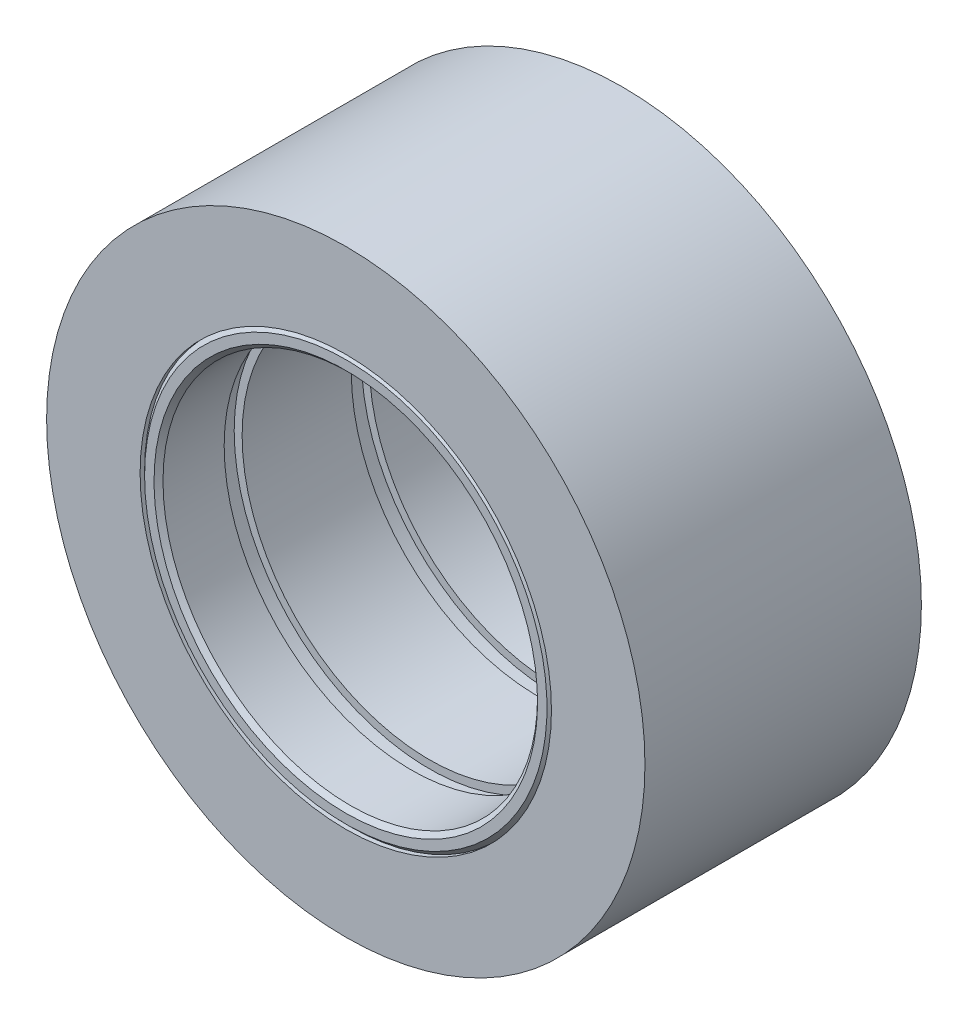
ISO-10303-21;
HEADER;
FILE_DESCRIPTION(('STEP AP214'),'2;1');
FILE_NAME('part.step','',(''),(''),'','','');
FILE_SCHEMA(('AUTOMOTIVE_DESIGN { 1 0 10303 214 1 1 1 1 }'));
ENDSEC;
DATA;
#1=APPLICATION_CONTEXT('core data for automotive mechanical design processes');
#2=APPLICATION_PROTOCOL_DEFINITION('international standard','automotive_design',2000,#1);
#3=PRODUCT_CONTEXT('',#1,'mechanical');
#4=PRODUCT('Part','Part','',(#3));
#5=PRODUCT_RELATED_PRODUCT_CATEGORY('part','',(#4));
#6=PRODUCT_DEFINITION_FORMATION('','',#4);
#7=PRODUCT_DEFINITION_CONTEXT('part definition',#1,'design');
#8=PRODUCT_DEFINITION('design','',#6,#7);
#9=PRODUCT_DEFINITION_SHAPE('','',#8);
#10=(LENGTH_UNIT() NAMED_UNIT(*) SI_UNIT(.MILLI.,.METRE.));
#11=(NAMED_UNIT(*) PLANE_ANGLE_UNIT() SI_UNIT($,.RADIAN.));
#12=(NAMED_UNIT(*) SI_UNIT($,.STERADIAN.) SOLID_ANGLE_UNIT());
#13=UNCERTAINTY_MEASURE_WITH_UNIT(LENGTH_MEASURE(1.E-05),#10,'distance_accuracy_value','');
#14=(GEOMETRIC_REPRESENTATION_CONTEXT(3) GLOBAL_UNCERTAINTY_ASSIGNED_CONTEXT((#13)) GLOBAL_UNIT_ASSIGNED_CONTEXT((#10,
#11,#12)) REPRESENTATION_CONTEXT('',''));
#15=CARTESIAN_POINT('',(0.,0.,0.));
#16=DIRECTION('',(0.,0.,1.));
#17=DIRECTION('',(1.,0.,0.));
#18=AXIS2_PLACEMENT_3D('',#15,#16,#17);
#19=CARTESIAN_POINT('',(0.,0.,0.));
#20=DIRECTION('',(0.,0.,1.));
#21=DIRECTION('',(1.,0.,0.));
#22=AXIS2_PLACEMENT_3D('',#19,#20,#21);
#23=CYLINDRICAL_SURFACE('',#22,17.4625);
#24=CARTESIAN_POINT('',(0.,0.,0.));
#25=DIRECTION('',(0.,0.,1.));
#26=DIRECTION('',(1.,0.,0.));
#27=AXIS2_PLACEMENT_3D('',#24,#25,#26);
#28=CIRCLE('',#27,17.4625);
#29=CARTESIAN_POINT('',(17.4625,0.,0.));
#30=VERTEX_POINT('',#29);
#31=EDGE_CURVE('P0_E27',#30,#30,#28,.F.);
#32=ORIENTED_EDGE('',*,*,#31,.T.);
#33=EDGE_LOOP('',(#32));
#34=FACE_BOUND('',#33,.T.);
#35=CARTESIAN_POINT('',(0.,0.,23.4696));
#36=DIRECTION('',(0.,0.,1.));
#37=DIRECTION('',(1.,0.,0.));
#38=AXIS2_PLACEMENT_3D('',#35,#36,#37);
#39=CIRCLE('',#38,17.4625);
#40=CARTESIAN_POINT('',(17.4625,0.,23.4696));
#41=VERTEX_POINT('',#40);
#42=EDGE_CURVE('P0_E18',#41,#41,#39,.F.);
#43=ORIENTED_EDGE('',*,*,#42,.F.);
#44=EDGE_LOOP('',(#43));
#45=FACE_BOUND('',#44,.T.);
#46=ADVANCED_FACE('P0_F15',(#34,#45),#23,.F.);
#47=CARTESIAN_POINT('',(0.,0.,23.4696));
#48=DIRECTION('',(0.,0.,1.));
#49=DIRECTION('',(1.,0.,0.));
#50=AXIS2_PLACEMENT_3D('',#47,#48,#49);
#51=PLANE('',#50);
#52=CARTESIAN_POINT('',(0.,0.,23.4696));
#53=DIRECTION('',(0.,0.,-1.));
#54=DIRECTION('',(-1.,0.,0.));
#55=AXIS2_PLACEMENT_3D('',#52,#53,#54);
#56=CIRCLE('',#55,25.4);
#57=CARTESIAN_POINT('',(-25.4,0.,23.4696));
#58=VERTEX_POINT('',#57);
#59=EDGE_CURVE('P0_E22',#58,#58,#56,.T.);
#60=ORIENTED_EDGE('',*,*,#59,.F.);
#61=EDGE_LOOP('',(#60));
#62=FACE_BOUND('',#61,.T.);
#63=ORIENTED_EDGE('',*,*,#42,.T.);
#64=EDGE_LOOP('',(#63));
#65=FACE_BOUND('',#64,.T.);
#66=ADVANCED_FACE('P0_F35',(#62,#65),#51,.T.);
#67=CARTESIAN_POINT('',(0.,0.,0.));
#68=DIRECTION('',(0.,0.,1.));
#69=DIRECTION('',(1.,0.,0.));
#70=AXIS2_PLACEMENT_3D('',#67,#68,#69);
#71=PLANE('',#70);
#72=CARTESIAN_POINT('',(0.,0.,0.));
#73=DIRECTION('',(0.,0.,-1.));
#74=DIRECTION('',(-1.,0.,0.));
#75=AXIS2_PLACEMENT_3D('',#72,#73,#74);
#76=CIRCLE('',#75,25.4);
#77=CARTESIAN_POINT('',(-25.4,0.,0.));
#78=VERTEX_POINT('',#77);
#79=EDGE_CURVE('P0_E10',#78,#78,#76,.F.);
#80=ORIENTED_EDGE('',*,*,#79,.F.);
#81=EDGE_LOOP('',(#80));
#82=FACE_BOUND('',#81,.T.);
#83=ORIENTED_EDGE('',*,*,#31,.F.);
#84=EDGE_LOOP('',(#83));
#85=FACE_BOUND('',#84,.T.);
#86=ADVANCED_FACE('P0_F42',(#82,#85),#71,.F.);
#87=CARTESIAN_POINT('',(0.,0.,23.4696));
#88=DIRECTION('',(0.,0.,-1.));
#89=DIRECTION('',(-1.,0.,0.));
#90=AXIS2_PLACEMENT_3D('',#87,#88,#89);
#91=CYLINDRICAL_SURFACE('',#90,25.4);
#92=ORIENTED_EDGE('',*,*,#79,.T.);
#93=EDGE_LOOP('',(#92));
#94=FACE_BOUND('',#93,.T.);
#95=ORIENTED_EDGE('',*,*,#59,.T.);
#96=EDGE_LOOP('',(#95));
#97=FACE_BOUND('',#96,.T.);
#98=ADVANCED_FACE('P0_F44',(#94,#97),#91,.T.);
#99=CLOSED_SHELL('',(#46,#66,#86,#98));
#100=MANIFOLD_SOLID_BREP('P0_B1',#99);
#101=CARTESIAN_POINT('',(0.,0.,23.4696));
#102=DIRECTION('',(0.,0.,-1.));
#103=DIRECTION('',(-1.,0.,0.));
#104=AXIS2_PLACEMENT_3D('',#101,#102,#103);
#105=CYLINDRICAL_SURFACE('',#104,15.9004);
#106=CARTESIAN_POINT('',(0.,0.,7.0993));
#107=DIRECTION('',(0.,0.,-1.));
#108=DIRECTION('',(-1.,0.,0.));
#109=AXIS2_PLACEMENT_3D('',#106,#107,#108);
#110=CIRCLE('',#109,15.9004);
#111=CARTESIAN_POINT('',(-15.9004,0.,7.0993));
#112=VERTEX_POINT('',#111);
#113=EDGE_CURVE('P1_E63',#112,#112,#110,.T.);
#114=ORIENTED_EDGE('',*,*,#113,.T.);
#115=EDGE_LOOP('',(#114));
#116=FACE_BOUND('',#115,.T.);
#117=CARTESIAN_POINT('',(0.,0.,16.3703));
#118=DIRECTION('',(0.,0.,-1.));
#119=DIRECTION('',(-1.,0.,0.));
#120=AXIS2_PLACEMENT_3D('',#117,#118,#119);
#121=CIRCLE('',#120,15.9004);
#122=CARTESIAN_POINT('',(-15.9004,0.,16.3703));
#123=VERTEX_POINT('',#122);
#124=EDGE_CURVE('P1_E17',#123,#123,#121,.T.);
#125=ORIENTED_EDGE('',*,*,#124,.F.);
#126=EDGE_LOOP('',(#125));
#127=FACE_BOUND('',#126,.T.);
#128=ADVANCED_FACE('P1_F14',(#116,#127),#105,.F.);
#129=CARTESIAN_POINT('',(0.,0.,16.3703));
#130=DIRECTION('',(0.,0.,1.));
#131=DIRECTION('',(1.,0.,0.));
#132=AXIS2_PLACEMENT_3D('',#129,#130,#131);
#133=PLANE('',#132);
#134=CARTESIAN_POINT('',(0.,0.,16.3703));
#135=DIRECTION('',(0.,0.,-1.));
#136=DIRECTION('',(-1.,0.,0.));
#137=AXIS2_PLACEMENT_3D('',#134,#135,#136);
#138=CIRCLE('',#137,16.5735);
#139=CARTESIAN_POINT('',(-16.5735,0.,16.3703));
#140=VERTEX_POINT('',#139);
#141=EDGE_CURVE('P1_E61',#140,#140,#138,.F.);
#142=ORIENTED_EDGE('',*,*,#141,.T.);
#143=EDGE_LOOP('',(#142));
#144=FACE_BOUND('',#143,.T.);
#145=ORIENTED_EDGE('',*,*,#124,.T.);
#146=EDGE_LOOP('',(#145));
#147=FACE_BOUND('',#146,.T.);
#148=ADVANCED_FACE('P1_F70',(#144,#147),#133,.T.);
#149=CARTESIAN_POINT('',(0.,0.,7.0993));
#150=DIRECTION('',(0.,0.,1.));
#151=DIRECTION('',(1.,0.,0.));
#152=AXIS2_PLACEMENT_3D('',#149,#150,#151);
#153=PLANE('',#152);
#154=CARTESIAN_POINT('',(0.,0.,7.0993));
#155=DIRECTION('',(0.,0.,1.));
#156=DIRECTION('',(1.,0.,0.));
#157=AXIS2_PLACEMENT_3D('',#154,#155,#156);
#158=CIRCLE('',#157,16.5735);
#159=CARTESIAN_POINT('',(16.5735,0.,7.0993));
#160=VERTEX_POINT('',#159);
#161=EDGE_CURVE('P1_E58',#160,#160,#158,.F.);
#162=ORIENTED_EDGE('',*,*,#161,.T.);
#163=EDGE_LOOP('',(#162));
#164=FACE_BOUND('',#163,.T.);
#165=ORIENTED_EDGE('',*,*,#113,.F.);
#166=EDGE_LOOP('',(#165));
#167=FACE_BOUND('',#166,.T.);
#168=ADVANCED_FACE('P1_F77',(#164,#167),#153,.F.);
#169=CARTESIAN_POINT('',(0.,0.,17.8943));
#170=DIRECTION('',(0.,0.,-1.));
#171=DIRECTION('',(-1.,0.,0.));
#172=AXIS2_PLACEMENT_3D('',#169,#170,#171);
#173=CYLINDRICAL_SURFACE('',#172,16.5735);
#174=ORIENTED_EDGE('',*,*,#141,.F.);
#175=EDGE_LOOP('',(#174));
#176=FACE_BOUND('',#175,.T.);
#177=CARTESIAN_POINT('',(0.,0.,17.8943));
#178=DIRECTION('',(0.,0.,-1.));
#179=DIRECTION('',(-1.,0.,0.));
#180=AXIS2_PLACEMENT_3D('',#177,#178,#179);
#181=CIRCLE('',#180,16.5735);
#182=CARTESIAN_POINT('',(-16.5735,0.,17.8943));
#183=VERTEX_POINT('',#182);
#184=EDGE_CURVE('P1_E55',#183,#183,#181,.F.);
#185=ORIENTED_EDGE('',*,*,#184,.T.);
#186=EDGE_LOOP('',(#185));
#187=FACE_BOUND('',#186,.T.);
#188=ADVANCED_FACE('P1_F129',(#176,#187),#173,.F.);
#189=CARTESIAN_POINT('',(0.,0.,5.5753));
#190=DIRECTION('',(0.,0.,1.));
#191=DIRECTION('',(1.,0.,0.));
#192=AXIS2_PLACEMENT_3D('',#189,#190,#191);
#193=CYLINDRICAL_SURFACE('',#192,16.5735);
#194=ORIENTED_EDGE('',*,*,#161,.F.);
#195=EDGE_LOOP('',(#194));
#196=FACE_BOUND('',#195,.T.);
#197=CARTESIAN_POINT('',(0.,0.,5.5753));
#198=DIRECTION('',(0.,0.,1.));
#199=DIRECTION('',(1.,0.,0.));
#200=AXIS2_PLACEMENT_3D('',#197,#198,#199);
#201=CIRCLE('',#200,16.5735);
#202=CARTESIAN_POINT('',(16.5735,0.,5.5753));
#203=VERTEX_POINT('',#202);
#204=EDGE_CURVE('P1_E52',#203,#203,#201,.T.);
#205=ORIENTED_EDGE('',*,*,#204,.F.);
#206=EDGE_LOOP('',(#205));
#207=FACE_BOUND('',#206,.T.);
#208=ADVANCED_FACE('P1_F125',(#196,#207),#193,.F.);
#209=CARTESIAN_POINT('',(0.,0.,17.8943));
#210=DIRECTION('',(0.,0.,1.));
#211=DIRECTION('',(1.,0.,0.));
#212=AXIS2_PLACEMENT_3D('',#209,#210,#211);
#213=PLANE('',#212);
#214=ORIENTED_EDGE('',*,*,#184,.F.);
#215=EDGE_LOOP('',(#214));
#216=FACE_BOUND('',#215,.T.);
#217=CARTESIAN_POINT('',(0.,0.,17.8943));
#218=DIRECTION('',(0.,0.,-1.));
#219=DIRECTION('',(-1.,0.,0.));
#220=AXIS2_PLACEMENT_3D('',#217,#218,#219);
#221=CIRCLE('',#220,15.9004);
#222=CARTESIAN_POINT('',(-15.9004,0.,17.8943));
#223=VERTEX_POINT('',#222);
#224=EDGE_CURVE('P1_E49',#223,#223,#221,.F.);
#225=ORIENTED_EDGE('',*,*,#224,.T.);
#226=EDGE_LOOP('',(#225));
#227=FACE_BOUND('',#226,.T.);
#228=ADVANCED_FACE('P1_F121',(#216,#227),#213,.F.);
#229=CARTESIAN_POINT('',(0.,0.,5.5753));
#230=DIRECTION('',(0.,0.,1.));
#231=DIRECTION('',(1.,0.,0.));
#232=AXIS2_PLACEMENT_3D('',#229,#230,#231);
#233=PLANE('',#232);
#234=ORIENTED_EDGE('',*,*,#204,.T.);
#235=EDGE_LOOP('',(#234));
#236=FACE_BOUND('',#235,.T.);
#237=CARTESIAN_POINT('',(0.,0.,5.5753));
#238=DIRECTION('',(0.,0.,-1.));
#239=DIRECTION('',(-1.,0.,0.));
#240=AXIS2_PLACEMENT_3D('',#237,#238,#239);
#241=CIRCLE('',#240,15.9004);
#242=CARTESIAN_POINT('',(-15.9004,0.,5.5753));
#243=VERTEX_POINT('',#242);
#244=EDGE_CURVE('P1_E36',#243,#243,#241,.T.);
#245=ORIENTED_EDGE('',*,*,#244,.T.);
#246=EDGE_LOOP('',(#245));
#247=FACE_BOUND('',#246,.T.);
#248=ADVANCED_FACE('P1_F117',(#236,#247),#233,.T.);
#249=CARTESIAN_POINT('',(0.,0.,23.4696));
#250=DIRECTION('',(0.,0.,-1.));
#251=DIRECTION('',(-1.,0.,0.));
#252=AXIS2_PLACEMENT_3D('',#249,#250,#251);
#253=CYLINDRICAL_SURFACE('',#252,15.9004);
#254=CARTESIAN_POINT('',(0.,0.,23.0886));
#255=DIRECTION('',(0.,0.,1.));
#256=DIRECTION('',(1.,0.,0.));
#257=AXIS2_PLACEMENT_3D('',#254,#255,#256);
#258=CIRCLE('',#257,15.9004);
#259=CARTESIAN_POINT('',(15.9004,0.,23.0886));
#260=VERTEX_POINT('',#259);
#261=EDGE_CURVE('P1_E33',#260,#260,#258,.T.);
#262=ORIENTED_EDGE('',*,*,#261,.T.);
#263=EDGE_LOOP('',(#262));
#264=FACE_BOUND('',#263,.T.);
#265=ORIENTED_EDGE('',*,*,#224,.F.);
#266=EDGE_LOOP('',(#265));
#267=FACE_BOUND('',#266,.T.);
#268=ADVANCED_FACE('P1_F113',(#264,#267),#253,.F.);
#269=CARTESIAN_POINT('',(0.,0.,23.4696));
#270=DIRECTION('',(0.,0.,-1.));
#271=DIRECTION('',(-1.,0.,0.));
#272=AXIS2_PLACEMENT_3D('',#269,#270,#271);
#273=CYLINDRICAL_SURFACE('',#272,15.9004);
#274=CARTESIAN_POINT('',(0.,0.,0.381000000000006));
#275=DIRECTION('',(0.,0.,-1.));
#276=DIRECTION('',(-1.,0.,0.));
#277=AXIS2_PLACEMENT_3D('',#274,#275,#276);
#278=CIRCLE('',#277,15.9004);
#279=CARTESIAN_POINT('',(-15.9004,0.,0.381000000000006));
#280=VERTEX_POINT('',#279);
#281=EDGE_CURVE('P1_E29',#280,#280,#278,.T.);
#282=ORIENTED_EDGE('',*,*,#281,.T.);
#283=EDGE_LOOP('',(#282));
#284=FACE_BOUND('',#283,.T.);
#285=ORIENTED_EDGE('',*,*,#244,.F.);
#286=EDGE_LOOP('',(#285));
#287=FACE_BOUND('',#286,.T.);
#288=ADVANCED_FACE('P1_F109',(#284,#287),#273,.F.);
#289=CARTESIAN_POINT('',(0.,0.,23.4696));
#290=DIRECTION('',(0.,0.,1.));
#291=DIRECTION('',(0.,-1.,0.));
#292=AXIS2_PLACEMENT_3D('',#289,#290,#291);
#293=CONICAL_SURFACE('',#292,16.2814,0.785398163397444);
#294=ORIENTED_EDGE('',*,*,#261,.F.);
#295=EDGE_LOOP('',(#294));
#296=FACE_BOUND('',#295,.T.);
#297=CARTESIAN_POINT('',(0.,0.,23.4696));
#298=DIRECTION('',(0.,0.,1.));
#299=DIRECTION('',(0.,-1.,0.));
#300=AXIS2_PLACEMENT_3D('',#297,#298,#299);
#301=CIRCLE('',#300,16.2814);
#302=CARTESIAN_POINT('',(0.,-16.2814,23.4696));
#303=VERTEX_POINT('',#302);
#304=EDGE_CURVE('P1_E32',#303,#303,#301,.F.);
#305=ORIENTED_EDGE('',*,*,#304,.F.);
#306=EDGE_LOOP('',(#305));
#307=FACE_BOUND('',#306,.T.);
#308=ADVANCED_FACE('P1_F105',(#296,#307),#293,.F.);
#309=CARTESIAN_POINT('',(0.,0.,0.));
#310=DIRECTION('',(0.,0.,-1.));
#311=DIRECTION('',(-1.,0.,0.));
#312=AXIS2_PLACEMENT_3D('',#309,#310,#311);
#313=CONICAL_SURFACE('',#312,16.2814,0.785398163397444);
#314=CARTESIAN_POINT('',(0.,0.,0.));
#315=DIRECTION('',(0.,0.,-1.));
#316=DIRECTION('',(-1.,0.,0.));
#317=AXIS2_PLACEMENT_3D('',#314,#315,#316);
#318=CIRCLE('',#317,16.2814);
#319=CARTESIAN_POINT('',(-16.2814,0.,0.));
#320=VERTEX_POINT('',#319);
#321=EDGE_CURVE('P1_E42',#320,#320,#318,.T.);
#322=ORIENTED_EDGE('',*,*,#321,.T.);
#323=EDGE_LOOP('',(#322));
#324=FACE_BOUND('',#323,.T.);
#325=ORIENTED_EDGE('',*,*,#281,.F.);
#326=EDGE_LOOP('',(#325));
#327=FACE_BOUND('',#326,.T.);
#328=ADVANCED_FACE('P1_F101',(#324,#327),#313,.F.);
#329=CARTESIAN_POINT('',(0.,0.,23.4696));
#330=DIRECTION('',(0.,0.,1.));
#331=DIRECTION('',(1.,0.,0.));
#332=AXIS2_PLACEMENT_3D('',#329,#330,#331);
#333=PLANE('',#332);
#334=CARTESIAN_POINT('',(0.,0.,23.4696));
#335=DIRECTION('',(0.,0.,-1.));
#336=DIRECTION('',(-1.,0.,0.));
#337=AXIS2_PLACEMENT_3D('',#334,#335,#336);
#338=CIRCLE('',#337,17.0815);
#339=CARTESIAN_POINT('',(-17.0815,0.,23.4696));
#340=VERTEX_POINT('',#339);
#341=EDGE_CURVE('P1_E39',#340,#340,#338,.T.);
#342=ORIENTED_EDGE('',*,*,#341,.F.);
#343=EDGE_LOOP('',(#342));
#344=FACE_BOUND('',#343,.T.);
#345=ORIENTED_EDGE('',*,*,#304,.T.);
#346=EDGE_LOOP('',(#345));
#347=FACE_BOUND('',#346,.T.);
#348=ADVANCED_FACE('P1_F97',(#344,#347),#333,.T.);
#349=CARTESIAN_POINT('',(0.,0.,0.));
#350=DIRECTION('',(0.,0.,1.));
#351=DIRECTION('',(1.,0.,0.));
#352=AXIS2_PLACEMENT_3D('',#349,#350,#351);
#353=PLANE('',#352);
#354=CARTESIAN_POINT('',(0.,0.,0.));
#355=DIRECTION('',(0.,0.,1.));
#356=DIRECTION('',(0.,-1.,0.));
#357=AXIS2_PLACEMENT_3D('',#354,#355,#356);
#358=CIRCLE('',#357,17.0815);
#359=CARTESIAN_POINT('',(0.,-17.0815,0.));
#360=VERTEX_POINT('',#359);
#361=EDGE_CURVE('P1_E26',#360,#360,#358,.T.);
#362=ORIENTED_EDGE('',*,*,#361,.F.);
#363=EDGE_LOOP('',(#362));
#364=FACE_BOUND('',#363,.T.);
#365=ORIENTED_EDGE('',*,*,#321,.F.);
#366=EDGE_LOOP('',(#365));
#367=FACE_BOUND('',#366,.T.);
#368=ADVANCED_FACE('P1_F93',(#364,#367),#353,.F.);
#369=CARTESIAN_POINT('',(0.,0.,23.0886));
#370=DIRECTION('',(0.,0.,-1.));
#371=DIRECTION('',(-1.,0.,0.));
#372=AXIS2_PLACEMENT_3D('',#369,#370,#371);
#373=CONICAL_SURFACE('',#372,17.4625,0.785398163397444);
#374=CARTESIAN_POINT('',(0.,0.,23.0886));
#375=DIRECTION('',(0.,0.,-1.));
#376=DIRECTION('',(-1.,0.,0.));
#377=AXIS2_PLACEMENT_3D('',#374,#375,#376);
#378=CIRCLE('',#377,17.4625);
#379=CARTESIAN_POINT('',(-17.4625,0.,23.0886));
#380=VERTEX_POINT('',#379);
#381=EDGE_CURVE('P1_E21',#380,#380,#378,.T.);
#382=ORIENTED_EDGE('',*,*,#381,.F.);
#383=EDGE_LOOP('',(#382));
#384=FACE_BOUND('',#383,.T.);
#385=ORIENTED_EDGE('',*,*,#341,.T.);
#386=EDGE_LOOP('',(#385));
#387=FACE_BOUND('',#386,.T.);
#388=ADVANCED_FACE('P1_F86',(#384,#387),#373,.T.);
#389=CARTESIAN_POINT('',(0.,0.,0.381000000000006));
#390=DIRECTION('',(0.,0.,1.));
#391=DIRECTION('',(0.,-1.,0.));
#392=AXIS2_PLACEMENT_3D('',#389,#390,#391);
#393=CONICAL_SURFACE('',#392,17.4625,0.785398163397444);
#394=CARTESIAN_POINT('',(0.,0.,0.381000000000006));
#395=DIRECTION('',(0.,0.,-1.));
#396=DIRECTION('',(-1.,0.,0.));
#397=AXIS2_PLACEMENT_3D('',#394,#395,#396);
#398=CIRCLE('',#397,17.4625);
#399=CARTESIAN_POINT('',(-17.4625,0.,0.381000000000006));
#400=VERTEX_POINT('',#399);
#401=EDGE_CURVE('P1_E9',#400,#400,#398,.F.);
#402=ORIENTED_EDGE('',*,*,#401,.F.);
#403=EDGE_LOOP('',(#402));
#404=FACE_BOUND('',#403,.T.);
#405=ORIENTED_EDGE('',*,*,#361,.T.);
#406=EDGE_LOOP('',(#405));
#407=FACE_BOUND('',#406,.T.);
#408=ADVANCED_FACE('P1_F81',(#404,#407),#393,.T.);
#409=CARTESIAN_POINT('',(0.,0.,23.4696));
#410=DIRECTION('',(0.,0.,-1.));
#411=DIRECTION('',(-1.,0.,0.));
#412=AXIS2_PLACEMENT_3D('',#409,#410,#411);
#413=CYLINDRICAL_SURFACE('',#412,17.4625);
#414=ORIENTED_EDGE('',*,*,#401,.T.);
#415=EDGE_LOOP('',(#414));
#416=FACE_BOUND('',#415,.T.);
#417=ORIENTED_EDGE('',*,*,#381,.T.);
#418=EDGE_LOOP('',(#417));
#419=FACE_BOUND('',#418,.T.);
#420=ADVANCED_FACE('P1_F79',(#416,#419),#413,.T.);
#421=CLOSED_SHELL('',(#128,#148,#168,#188,#208,#228,#248,#268,#288,#308,#328,#348,#368,#388,
#408,#420));
#422=MANIFOLD_SOLID_BREP('P1_B1',#421);
#423=ADVANCED_BREP_SHAPE_REPRESENTATION('',(#18,#100,#422),#14);
#424=SHAPE_DEFINITION_REPRESENTATION(#9,#423);
ENDSEC;
END-ISO-10303-21;
